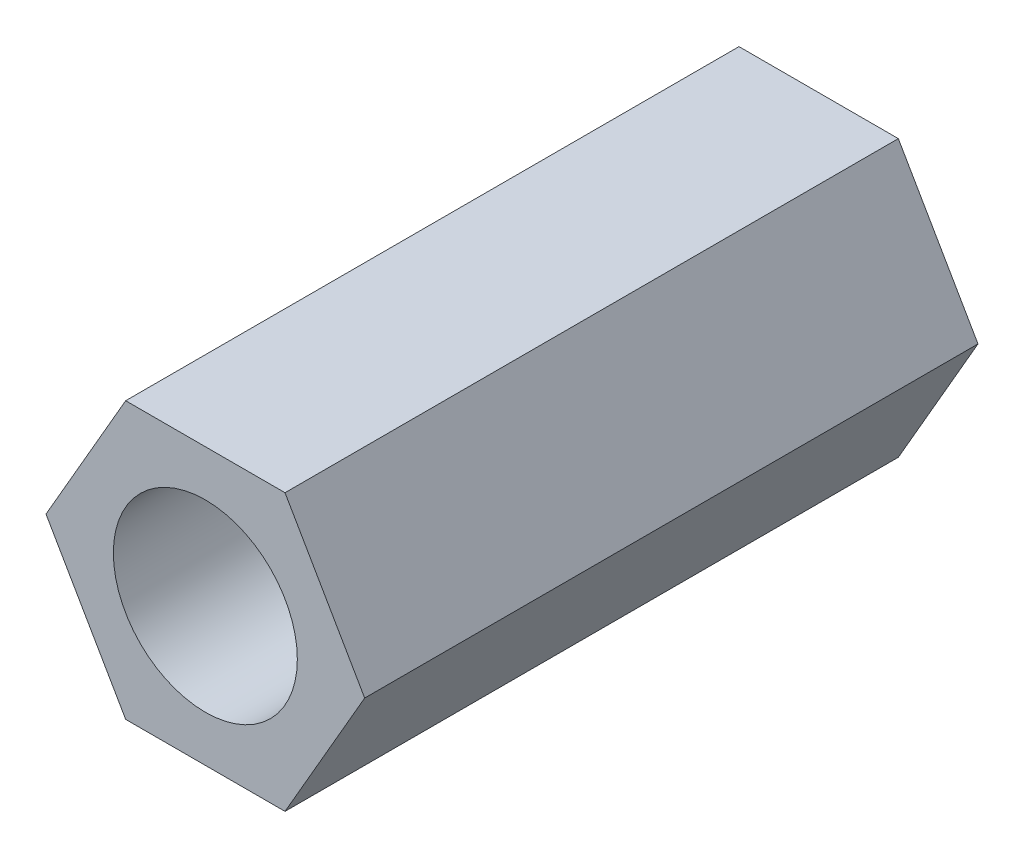
ISO-10303-21;
HEADER;
FILE_DESCRIPTION(('STEP AP214'),'2;1');
FILE_NAME('part.step','',(''),(''),'','','');
FILE_SCHEMA(('AUTOMOTIVE_DESIGN { 1 0 10303 214 1 1 1 1 }'));
ENDSEC;
DATA;
#1=APPLICATION_CONTEXT('core data for automotive mechanical design processes');
#2=APPLICATION_PROTOCOL_DEFINITION('international standard','automotive_design',2000,#1);
#3=PRODUCT_CONTEXT('',#1,'mechanical');
#4=PRODUCT('Part','Part','',(#3));
#5=PRODUCT_RELATED_PRODUCT_CATEGORY('part','',(#4));
#6=PRODUCT_DEFINITION_FORMATION('','',#4);
#7=PRODUCT_DEFINITION_CONTEXT('part definition',#1,'design');
#8=PRODUCT_DEFINITION('design','',#6,#7);
#9=PRODUCT_DEFINITION_SHAPE('','',#8);
#10=(LENGTH_UNIT() NAMED_UNIT(*) SI_UNIT(.MILLI.,.METRE.));
#11=(NAMED_UNIT(*) PLANE_ANGLE_UNIT() SI_UNIT($,.RADIAN.));
#12=(NAMED_UNIT(*) SI_UNIT($,.STERADIAN.) SOLID_ANGLE_UNIT());
#13=UNCERTAINTY_MEASURE_WITH_UNIT(LENGTH_MEASURE(1.E-05),#10,'distance_accuracy_value','');
#14=(GEOMETRIC_REPRESENTATION_CONTEXT(3) GLOBAL_UNCERTAINTY_ASSIGNED_CONTEXT((#13)) GLOBAL_UNIT_ASSIGNED_CONTEXT((#10,
#11,#12)) REPRESENTATION_CONTEXT('',''));
#15=CARTESIAN_POINT('',(0.,0.,0.));
#16=DIRECTION('',(0.,0.,1.));
#17=DIRECTION('',(1.,0.,0.));
#18=AXIS2_PLACEMENT_3D('',#15,#16,#17);
#19=CARTESIAN_POINT('',(0.,0.,10.));
#20=DIRECTION('',(0.,0.,1.));
#21=DIRECTION('',(1.,0.,0.));
#22=AXIS2_PLACEMENT_3D('',#19,#20,#21);
#23=PLANE('',#22);
#24=DIRECTION('',(0.499999999999995,0.866025403784442,0.));
#25=VECTOR('',#24,1.);
#26=CARTESIAN_POINT('',(1.29903810567668,-2.24999999999998,10.));
#27=LINE('',#26,#25);
#28=CARTESIAN_POINT('',(1.29903810567668,-2.24999999999998,10.));
#29=VERTEX_POINT('',#28);
#30=CARTESIAN_POINT('',(2.59807621135331,0.,10.));
#31=VERTEX_POINT('',#30);
#32=EDGE_CURVE('E129',#29,#31,#27,.T.);
#33=ORIENTED_EDGE('',*,*,#32,.T.);
#34=DIRECTION('',(-0.500000000000001,0.866025403784438,0.));
#35=VECTOR('',#34,1.);
#36=CARTESIAN_POINT('',(2.59807621135331,0.,10.));
#37=LINE('',#36,#35);
#38=CARTESIAN_POINT('',(1.29903810567665,2.24999999999999,10.));
#39=VERTEX_POINT('',#38);
#40=EDGE_CURVE('E87',#31,#39,#37,.T.);
#41=ORIENTED_EDGE('',*,*,#40,.T.);
#42=DIRECTION('',(-1.,0.,0.));
#43=VECTOR('',#42,1.);
#44=CARTESIAN_POINT('',(1.29903810567665,2.24999999999999,10.));
#45=LINE('',#44,#43);
#46=CARTESIAN_POINT('',(-1.29903810567666,2.24999999999999,10.));
#47=VERTEX_POINT('',#46);
#48=EDGE_CURVE('E100',#39,#47,#45,.T.);
#49=ORIENTED_EDGE('',*,*,#48,.T.);
#50=DIRECTION('',(-0.499999999999995,-0.866025403784441,0.));
#51=VECTOR('',#50,1.);
#52=CARTESIAN_POINT('',(-1.29903810567666,2.24999999999999,10.));
#53=LINE('',#52,#51);
#54=CARTESIAN_POINT('',(-2.59807621135331,0.,10.));
#55=VERTEX_POINT('',#54);
#56=EDGE_CURVE('E94',#47,#55,#53,.T.);
#57=ORIENTED_EDGE('',*,*,#56,.T.);
#58=DIRECTION('',(0.500000000000007,-0.866025403784434,0.));
#59=VECTOR('',#58,1.);
#60=CARTESIAN_POINT('',(-2.59807621135331,0.,10.));
#61=LINE('',#60,#59);
#62=CARTESIAN_POINT('',(-1.29903810567663,-2.25,10.));
#63=VERTEX_POINT('',#62);
#64=EDGE_CURVE('E98',#55,#63,#61,.T.);
#65=ORIENTED_EDGE('',*,*,#64,.T.);
#66=DIRECTION('',(1.,0.,0.));
#67=VECTOR('',#66,1.);
#68=CARTESIAN_POINT('',(-1.29903810567663,-2.25,10.));
#69=LINE('',#68,#67);
#70=EDGE_CURVE('E50',#63,#29,#69,.T.);
#71=ORIENTED_EDGE('',*,*,#70,.T.);
#72=EDGE_LOOP('',(#33,#41,#49,#57,#65,#71));
#73=FACE_BOUND('',#72,.T.);
#74=CARTESIAN_POINT('',(0.,0.,10.));
#75=DIRECTION('',(0.,0.,1.));
#76=DIRECTION('',(1.,0.,0.));
#77=AXIS2_PLACEMENT_3D('',#74,#75,#76);
#78=CIRCLE('',#77,1.5);
#79=CARTESIAN_POINT('',(1.5,0.,10.));
#80=VERTEX_POINT('',#79);
#81=EDGE_CURVE('E122',#80,#80,#78,.T.);
#82=ORIENTED_EDGE('',*,*,#81,.F.);
#83=EDGE_LOOP('',(#82));
#84=FACE_BOUND('',#83,.T.);
#85=ADVANCED_FACE('F33',(#73,#84),#23,.T.);
#86=CARTESIAN_POINT('',(0.,0.,0.));
#87=DIRECTION('',(0.,0.,1.));
#88=DIRECTION('',(1.,0.,0.));
#89=AXIS2_PLACEMENT_3D('',#86,#87,#88);
#90=PLANE('',#89);
#91=DIRECTION('',(0.499999999999995,0.866025403784442,0.));
#92=VECTOR('',#91,1.);
#93=CARTESIAN_POINT('',(1.29903810567668,-2.24999999999998,0.));
#94=LINE('',#93,#92);
#95=CARTESIAN_POINT('',(1.29903810567668,-2.24999999999998,0.));
#96=VERTEX_POINT('',#95);
#97=CARTESIAN_POINT('',(2.59807621135331,0.,0.));
#98=VERTEX_POINT('',#97);
#99=EDGE_CURVE('E118',#96,#98,#94,.T.);
#100=ORIENTED_EDGE('',*,*,#99,.F.);
#101=DIRECTION('',(1.,0.,0.));
#102=VECTOR('',#101,1.);
#103=CARTESIAN_POINT('',(-1.29903810567663,-2.25,0.));
#104=LINE('',#103,#102);
#105=CARTESIAN_POINT('',(-1.29903810567663,-2.25,0.));
#106=VERTEX_POINT('',#105);
#107=EDGE_CURVE('E79',#106,#96,#104,.T.);
#108=ORIENTED_EDGE('',*,*,#107,.F.);
#109=DIRECTION('',(0.500000000000007,-0.866025403784434,0.));
#110=VECTOR('',#109,1.);
#111=CARTESIAN_POINT('',(-2.59807621135331,0.,0.));
#112=LINE('',#111,#110);
#113=CARTESIAN_POINT('',(-2.59807621135331,0.,0.));
#114=VERTEX_POINT('',#113);
#115=EDGE_CURVE('E73',#114,#106,#112,.T.);
#116=ORIENTED_EDGE('',*,*,#115,.F.);
#117=DIRECTION('',(-0.499999999999995,-0.866025403784441,0.));
#118=VECTOR('',#117,1.);
#119=CARTESIAN_POINT('',(-1.29903810567666,2.24999999999999,0.));
#120=LINE('',#119,#118);
#121=CARTESIAN_POINT('',(-1.29903810567666,2.24999999999999,0.));
#122=VERTEX_POINT('',#121);
#123=EDGE_CURVE('E108',#122,#114,#120,.T.);
#124=ORIENTED_EDGE('',*,*,#123,.F.);
#125=DIRECTION('',(-1.,0.,0.));
#126=VECTOR('',#125,1.);
#127=CARTESIAN_POINT('',(1.29903810567665,2.24999999999999,0.));
#128=LINE('',#127,#126);
#129=CARTESIAN_POINT('',(1.29903810567665,2.24999999999999,0.));
#130=VERTEX_POINT('',#129);
#131=EDGE_CURVE('E124',#130,#122,#128,.T.);
#132=ORIENTED_EDGE('',*,*,#131,.F.);
#133=DIRECTION('',(-0.500000000000001,0.866025403784438,0.));
#134=VECTOR('',#133,1.);
#135=CARTESIAN_POINT('',(2.59807621135331,0.,0.));
#136=LINE('',#135,#134);
#137=EDGE_CURVE('E121',#98,#130,#136,.T.);
#138=ORIENTED_EDGE('',*,*,#137,.F.);
#139=EDGE_LOOP('',(#100,#108,#116,#124,#132,#138));
#140=FACE_BOUND('',#139,.T.);
#141=CARTESIAN_POINT('',(0.,0.,0.));
#142=DIRECTION('',(0.,0.,1.));
#143=DIRECTION('',(1.,0.,0.));
#144=AXIS2_PLACEMENT_3D('',#141,#142,#143);
#145=CIRCLE('',#144,1.5);
#146=CARTESIAN_POINT('',(1.5,0.,0.));
#147=VERTEX_POINT('',#146);
#148=EDGE_CURVE('E222',#147,#147,#145,.T.);
#149=ORIENTED_EDGE('',*,*,#148,.T.);
#150=EDGE_LOOP('',(#149));
#151=FACE_BOUND('',#150,.T.);
#152=ADVANCED_FACE('F138',(#140,#151),#90,.F.);
#153=CARTESIAN_POINT('',(1.29903810567668,-2.24999999999998,10.));
#154=DIRECTION('',(-0.866025403784442,0.499999999999995,0.));
#155=DIRECTION('',(-0.499999999999995,-0.866025403784442,0.));
#156=AXIS2_PLACEMENT_3D('',#153,#154,#155);
#157=PLANE('',#156);
#158=ORIENTED_EDGE('',*,*,#99,.T.);
#159=DIRECTION('',(0.,0.,-1.));
#160=VECTOR('',#159,1.);
#161=CARTESIAN_POINT('',(2.59807621135331,0.,10.));
#162=LINE('',#161,#160);
#163=EDGE_CURVE('E11',#31,#98,#162,.T.);
#164=ORIENTED_EDGE('',*,*,#163,.F.);
#165=ORIENTED_EDGE('',*,*,#32,.F.);
#166=DIRECTION('',(0.,0.,-1.));
#167=VECTOR('',#166,1.);
#168=CARTESIAN_POINT('',(1.29903810567668,-2.24999999999998,10.));
#169=LINE('',#168,#167);
#170=EDGE_CURVE('E114',#29,#96,#169,.T.);
#171=ORIENTED_EDGE('',*,*,#170,.T.);
#172=EDGE_LOOP('',(#158,#164,#165,#171));
#173=FACE_BOUND('',#172,.T.);
#174=ADVANCED_FACE('F35',(#173),#157,.F.);
#175=CARTESIAN_POINT('',(2.59807621135331,0.,10.));
#176=DIRECTION('',(-0.866025403784438,-0.500000000000001,0.));
#177=DIRECTION('',(0.500000000000001,-0.866025403784438,0.));
#178=AXIS2_PLACEMENT_3D('',#175,#176,#177);
#179=PLANE('',#178);
#180=ORIENTED_EDGE('',*,*,#137,.T.);
#181=DIRECTION('',(0.,0.,-1.));
#182=VECTOR('',#181,1.);
#183=CARTESIAN_POINT('',(1.29903810567665,2.24999999999999,10.));
#184=LINE('',#183,#182);
#185=EDGE_CURVE('E42',#39,#130,#184,.T.);
#186=ORIENTED_EDGE('',*,*,#185,.F.);
#187=ORIENTED_EDGE('',*,*,#40,.F.);
#188=ORIENTED_EDGE('',*,*,#163,.T.);
#189=EDGE_LOOP('',(#180,#186,#187,#188));
#190=FACE_BOUND('',#189,.T.);
#191=ADVANCED_FACE('F163',(#190),#179,.F.);
#192=CARTESIAN_POINT('',(1.29903810567665,2.24999999999999,10.));
#193=DIRECTION('',(0.,-1.,0.));
#194=DIRECTION('',(1.,0.,0.));
#195=AXIS2_PLACEMENT_3D('',#192,#193,#194);
#196=PLANE('',#195);
#197=ORIENTED_EDGE('',*,*,#131,.T.);
#198=DIRECTION('',(0.,0.,-1.));
#199=VECTOR('',#198,1.);
#200=CARTESIAN_POINT('',(-1.29903810567666,2.24999999999999,10.));
#201=LINE('',#200,#199);
#202=EDGE_CURVE('E109',#47,#122,#201,.T.);
#203=ORIENTED_EDGE('',*,*,#202,.F.);
#204=ORIENTED_EDGE('',*,*,#48,.F.);
#205=ORIENTED_EDGE('',*,*,#185,.T.);
#206=EDGE_LOOP('',(#197,#203,#204,#205));
#207=FACE_BOUND('',#206,.T.);
#208=ADVANCED_FACE('F135',(#207),#196,.F.);
#209=CARTESIAN_POINT('',(-1.29903810567666,2.24999999999999,10.));
#210=DIRECTION('',(0.866025403784442,-0.499999999999995,0.));
#211=DIRECTION('',(0.499999999999995,0.866025403784442,0.));
#212=AXIS2_PLACEMENT_3D('',#209,#210,#211);
#213=PLANE('',#212);
#214=ORIENTED_EDGE('',*,*,#123,.T.);
#215=DIRECTION('',(0.,0.,-1.));
#216=VECTOR('',#215,1.);
#217=CARTESIAN_POINT('',(-2.59807621135331,0.,10.));
#218=LINE('',#217,#216);
#219=EDGE_CURVE('E105',#55,#114,#218,.T.);
#220=ORIENTED_EDGE('',*,*,#219,.F.);
#221=ORIENTED_EDGE('',*,*,#56,.F.);
#222=ORIENTED_EDGE('',*,*,#202,.T.);
#223=EDGE_LOOP('',(#214,#220,#221,#222));
#224=FACE_BOUND('',#223,.T.);
#225=ADVANCED_FACE('F106',(#224),#213,.F.);
#226=CARTESIAN_POINT('',(-2.59807621135331,0.,10.));
#227=DIRECTION('',(0.866025403784434,0.500000000000007,0.));
#228=DIRECTION('',(-0.500000000000007,0.866025403784435,0.));
#229=AXIS2_PLACEMENT_3D('',#226,#227,#228);
#230=PLANE('',#229);
#231=ORIENTED_EDGE('',*,*,#115,.T.);
#232=DIRECTION('',(0.,0.,-1.));
#233=VECTOR('',#232,1.);
#234=CARTESIAN_POINT('',(-1.29903810567663,-2.25,10.));
#235=LINE('',#234,#233);
#236=EDGE_CURVE('E110',#63,#106,#235,.T.);
#237=ORIENTED_EDGE('',*,*,#236,.F.);
#238=ORIENTED_EDGE('',*,*,#64,.F.);
#239=ORIENTED_EDGE('',*,*,#219,.T.);
#240=EDGE_LOOP('',(#231,#237,#238,#239));
#241=FACE_BOUND('',#240,.T.);
#242=ADVANCED_FACE('F112',(#241),#230,.F.);
#243=CARTESIAN_POINT('',(-1.29903810567663,-2.25,10.));
#244=DIRECTION('',(0.,1.,0.));
#245=DIRECTION('',(-1.,0.,0.));
#246=AXIS2_PLACEMENT_3D('',#243,#244,#245);
#247=PLANE('',#246);
#248=ORIENTED_EDGE('',*,*,#107,.T.);
#249=ORIENTED_EDGE('',*,*,#170,.F.);
#250=ORIENTED_EDGE('',*,*,#70,.F.);
#251=ORIENTED_EDGE('',*,*,#236,.T.);
#252=EDGE_LOOP('',(#248,#249,#250,#251));
#253=FACE_BOUND('',#252,.T.);
#254=ADVANCED_FACE('F143',(#253),#247,.F.);
#255=CARTESIAN_POINT('',(0.,0.,10.));
#256=DIRECTION('',(0.,0.,-1.));
#257=DIRECTION('',(-1.,0.,0.));
#258=AXIS2_PLACEMENT_3D('',#255,#256,#257);
#259=CYLINDRICAL_SURFACE('',#258,1.5);
#260=ORIENTED_EDGE('',*,*,#81,.T.);
#261=EDGE_LOOP('',(#260));
#262=FACE_BOUND('',#261,.T.);
#263=ORIENTED_EDGE('',*,*,#148,.F.);
#264=EDGE_LOOP('',(#263));
#265=FACE_BOUND('',#264,.T.);
#266=ADVANCED_FACE('F145',(#262,#265),#259,.F.);
#267=CLOSED_SHELL('',(#85,#152,#174,#191,#208,#225,#242,#254,#266));
#268=MANIFOLD_SOLID_BREP('B2',#267);
#269=ADVANCED_BREP_SHAPE_REPRESENTATION('',(#18,#268),#14);
#270=SHAPE_DEFINITION_REPRESENTATION(#9,#269);
ENDSEC;
END-ISO-10303-21;
